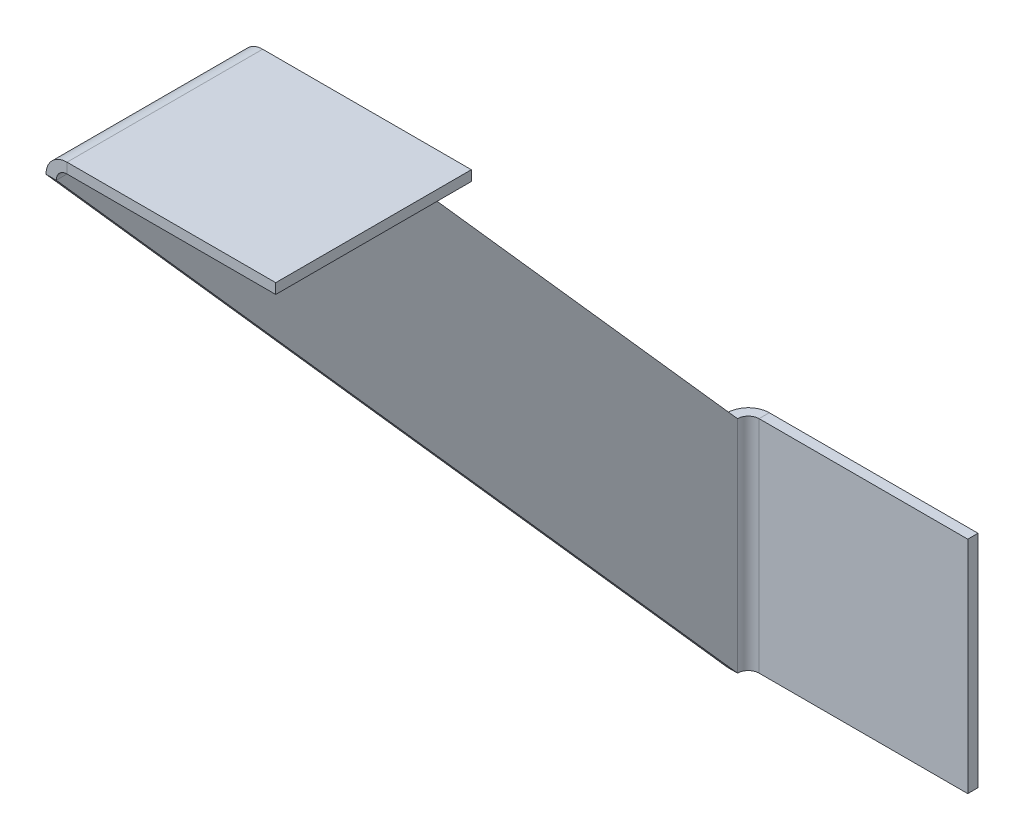
ISO-10303-21;
HEADER;
FILE_DESCRIPTION(('STEP AP214'),'2;1');
FILE_NAME('part.step','',(''),(''),'','','');
FILE_SCHEMA(('AUTOMOTIVE_DESIGN { 1 0 10303 214 1 1 1 1 }'));
ENDSEC;
DATA;
#1=APPLICATION_CONTEXT('core data for automotive mechanical design processes');
#2=APPLICATION_PROTOCOL_DEFINITION('international standard','automotive_design',2000,#1);
#3=PRODUCT_CONTEXT('',#1,'mechanical');
#4=PRODUCT('Part','Part','',(#3));
#5=PRODUCT_RELATED_PRODUCT_CATEGORY('part','',(#4));
#6=PRODUCT_DEFINITION_FORMATION('','',#4);
#7=PRODUCT_DEFINITION_CONTEXT('part definition',#1,'design');
#8=PRODUCT_DEFINITION('design','',#6,#7);
#9=PRODUCT_DEFINITION_SHAPE('','',#8);
#10=(LENGTH_UNIT() NAMED_UNIT(*) SI_UNIT(.MILLI.,.METRE.));
#11=(NAMED_UNIT(*) PLANE_ANGLE_UNIT() SI_UNIT($,.RADIAN.));
#12=(NAMED_UNIT(*) SI_UNIT($,.STERADIAN.) SOLID_ANGLE_UNIT());
#13=UNCERTAINTY_MEASURE_WITH_UNIT(LENGTH_MEASURE(1.E-05),#10,'distance_accuracy_value','');
#14=(GEOMETRIC_REPRESENTATION_CONTEXT(3) GLOBAL_UNCERTAINTY_ASSIGNED_CONTEXT((#13)) GLOBAL_UNIT_ASSIGNED_CONTEXT((#10,
#11,#12)) REPRESENTATION_CONTEXT('',''));
#15=CARTESIAN_POINT('',(0.,0.,0.));
#16=DIRECTION('',(0.,0.,1.));
#17=DIRECTION('',(1.,0.,0.));
#18=AXIS2_PLACEMENT_3D('',#15,#16,#17);
#19=CARTESIAN_POINT('',(-0.7,-37.3944766030146,-33.1911602627355));
#20=DIRECTION('',(0.,0.663823205254711,-0.747889532060292));
#21=DIRECTION('',(0.,0.747889532060292,0.663823205254711));
#22=AXIS2_PLACEMENT_3D('',#19,#20,#21);
#23=PLANE('',#22);
#24=DIRECTION('',(0.,0.747889532060292,0.66382320525471));
#25=VECTOR('',#24,1.);
#26=CARTESIAN_POINT('',(0.,-37.3944766030146,-33.1911602627355));
#27=LINE('',#26,#25);
#28=CARTESIAN_POINT('',(0.,-37.3944766030146,-33.1911602627355));
#29=VERTEX_POINT('',#28);
#30=CARTESIAN_POINT('',(0.,0.,0.));
#31=VERTEX_POINT('',#30);
#32=EDGE_CURVE('E112',#29,#31,#27,.T.);
#33=ORIENTED_EDGE('',*,*,#32,.F.);
#34=DIRECTION('',(1.,0.,0.));
#35=VECTOR('',#34,1.);
#36=CARTESIAN_POINT('',(-0.7,-37.3944766030146,-33.1911602627355));
#37=LINE('',#36,#35);
#38=CARTESIAN_POINT('',(-0.7,-37.3944766030146,-33.1911602627355));
#39=VERTEX_POINT('',#38);
#40=EDGE_CURVE('E13',#39,#29,#37,.T.);
#41=ORIENTED_EDGE('',*,*,#40,.F.);
#42=DIRECTION('',(0.,0.747889532060292,0.66382320525471));
#43=VECTOR('',#42,1.);
#44=CARTESIAN_POINT('',(-0.7,-37.3944766030146,-33.1911602627355));
#45=LINE('',#44,#43);
#46=CARTESIAN_POINT('',(-0.7,0.,0.));
#47=VERTEX_POINT('',#46);
#48=EDGE_CURVE('E132',#39,#47,#45,.T.);
#49=ORIENTED_EDGE('',*,*,#48,.T.);
#50=DIRECTION('',(1.,0.,0.));
#51=VECTOR('',#50,1.);
#52=CARTESIAN_POINT('',(-0.7,0.,0.));
#53=LINE('',#52,#51);
#54=EDGE_CURVE('E78',#47,#31,#53,.T.);
#55=ORIENTED_EDGE('',*,*,#54,.T.);
#56=EDGE_LOOP('',(#33,#41,#49,#55));
#57=FACE_BOUND('',#56,.T.);
#58=ADVANCED_FACE('F75',(#57),#23,.T.);
#59=CARTESIAN_POINT('',(-0.7,0.,13.3709586393754));
#60=DIRECTION('',(0.,-0.663823205254711,0.747889532060292));
#61=DIRECTION('',(0.,-0.747889532060292,-0.663823205254711));
#62=AXIS2_PLACEMENT_3D('',#59,#60,#61);
#63=PLANE('',#62);
#64=DIRECTION('',(0.,-0.747889532060292,-0.663823205254711));
#65=VECTOR('',#64,1.);
#66=CARTESIAN_POINT('',(0.,0.,13.3709586393754));
#67=LINE('',#66,#65);
#68=CARTESIAN_POINT('',(0.,0.,13.3709586393754));
#69=VERTEX_POINT('',#68);
#70=CARTESIAN_POINT('',(0.,-52.458728531603,-33.1911602627355));
#71=VERTEX_POINT('',#70);
#72=EDGE_CURVE('E127',#69,#71,#67,.T.);
#73=ORIENTED_EDGE('',*,*,#72,.F.);
#74=DIRECTION('',(1.,0.,0.));
#75=VECTOR('',#74,1.);
#76=CARTESIAN_POINT('',(-0.7,0.,13.3709586393754));
#77=LINE('',#76,#75);
#78=CARTESIAN_POINT('',(-0.699999999999999,0.,13.3709586393754));
#79=VERTEX_POINT('',#78);
#80=EDGE_CURVE('E214',#79,#69,#77,.T.);
#81=ORIENTED_EDGE('',*,*,#80,.F.);
#82=DIRECTION('',(0.,-0.747889532060292,-0.663823205254711));
#83=VECTOR('',#82,1.);
#84=CARTESIAN_POINT('',(-0.7,0.,13.3709586393754));
#85=LINE('',#84,#83);
#86=CARTESIAN_POINT('',(-0.7,-52.458728531603,-33.1911602627355));
#87=VERTEX_POINT('',#86);
#88=EDGE_CURVE('E93',#79,#87,#85,.T.);
#89=ORIENTED_EDGE('',*,*,#88,.T.);
#90=DIRECTION('',(1.,0.,0.));
#91=VECTOR('',#90,1.);
#92=CARTESIAN_POINT('',(-0.7,-52.458728531603,-33.1911602627355));
#93=LINE('',#92,#91);
#94=EDGE_CURVE('E84',#87,#71,#93,.T.);
#95=ORIENTED_EDGE('',*,*,#94,.T.);
#96=EDGE_LOOP('',(#73,#81,#89,#95));
#97=FACE_BOUND('',#96,.T.);
#98=ADVANCED_FACE('F338',(#97),#63,.T.);
#99=CARTESIAN_POINT('',(-0.7,0.,0.));
#100=DIRECTION('',(1.,0.,0.));
#101=DIRECTION('',(0.,0.,-1.));
#102=AXIS2_PLACEMENT_3D('',#99,#100,#101);
#103=PLANE('',#102);
#104=ORIENTED_EDGE('',*,*,#48,.F.);
#105=DIRECTION('',(0.,1.,0.));
#106=VECTOR('',#105,1.);
#107=CARTESIAN_POINT('',(-0.7,-52.458728531603,-33.1911602627355));
#108=LINE('',#107,#106);
#109=EDGE_CURVE('E210',#87,#39,#108,.T.);
#110=ORIENTED_EDGE('',*,*,#109,.F.);
#111=ORIENTED_EDGE('',*,*,#88,.F.);
#112=DIRECTION('',(0.,0.,1.));
#113=VECTOR('',#112,1.);
#114=CARTESIAN_POINT('',(-0.7,0.,0.));
#115=LINE('',#114,#113);
#116=EDGE_CURVE('E206',#47,#79,#115,.T.);
#117=ORIENTED_EDGE('',*,*,#116,.F.);
#118=EDGE_LOOP('',(#104,#110,#111,#117));
#119=FACE_BOUND('',#118,.T.);
#120=ADVANCED_FACE('F259',(#119),#103,.F.);
#121=CARTESIAN_POINT('',(0.,0.,0.));
#122=DIRECTION('',(1.,0.,0.));
#123=DIRECTION('',(0.,0.,-1.));
#124=AXIS2_PLACEMENT_3D('',#121,#122,#123);
#125=PLANE('',#124);
#126=ORIENTED_EDGE('',*,*,#32,.T.);
#127=DIRECTION('',(0.,0.,1.));
#128=VECTOR('',#127,1.);
#129=CARTESIAN_POINT('',(0.,0.,0.));
#130=LINE('',#129,#128);
#131=EDGE_CURVE('E121',#31,#69,#130,.T.);
#132=ORIENTED_EDGE('',*,*,#131,.T.);
#133=ORIENTED_EDGE('',*,*,#72,.T.);
#134=DIRECTION('',(0.,1.,0.));
#135=VECTOR('',#134,1.);
#136=CARTESIAN_POINT('',(0.,-52.458728531603,-33.1911602627355));
#137=LINE('',#136,#135);
#138=EDGE_CURVE('E125',#71,#29,#137,.T.);
#139=ORIENTED_EDGE('',*,*,#138,.T.);
#140=EDGE_LOOP('',(#126,#132,#133,#139));
#141=FACE_BOUND('',#140,.T.);
#142=ADVANCED_FACE('F126',(#141),#125,.T.);
#143=CARTESIAN_POINT('',(0.7366,0.,0.));
#144=DIRECTION('',(0.,0.,-1.));
#145=DIRECTION('',(0.,1.,0.));
#146=AXIS2_PLACEMENT_3D('',#143,#144,#145);
#147=PLANE('',#146);
#148=DIRECTION('',(0.,-1.,0.));
#149=VECTOR('',#148,1.);
#150=CARTESIAN_POINT('',(0.736599999999995,1.4366,0.));
#151=LINE('',#150,#149);
#152=CARTESIAN_POINT('',(0.736599999999998,0.7366,0.));
#153=VERTEX_POINT('',#152);
#154=CARTESIAN_POINT('',(0.736599999999995,1.4366,0.));
#155=VERTEX_POINT('',#154);
#156=EDGE_CURVE('E191',#153,#155,#151,.F.);
#157=ORIENTED_EDGE('',*,*,#156,.F.);
#158=CARTESIAN_POINT('',(0.7366,0.,0.));
#159=DIRECTION('',(0.,0.,1.));
#160=DIRECTION('',(0.,-1.,0.));
#161=AXIS2_PLACEMENT_3D('',#158,#159,#160);
#162=CIRCLE('',#161,0.736599999999999);
#163=EDGE_CURVE('E200',#31,#153,#162,.F.);
#164=ORIENTED_EDGE('',*,*,#163,.F.);
#165=ORIENTED_EDGE('',*,*,#54,.F.);
#166=CARTESIAN_POINT('',(0.7366,0.,0.));
#167=DIRECTION('',(0.,0.,1.));
#168=DIRECTION('',(0.,-1.,0.));
#169=AXIS2_PLACEMENT_3D('',#166,#167,#168);
#170=CIRCLE('',#169,1.4366);
#171=EDGE_CURVE('E122',#47,#155,#170,.F.);
#172=ORIENTED_EDGE('',*,*,#171,.T.);
#173=EDGE_LOOP('',(#157,#164,#165,#172));
#174=FACE_BOUND('',#173,.T.);
#175=ADVANCED_FACE('F348',(#174),#147,.T.);
#176=CARTESIAN_POINT('',(0.7366,0.,13.3709586393754));
#177=DIRECTION('',(0.,0.,-1.));
#178=DIRECTION('',(0.,1.,0.));
#179=AXIS2_PLACEMENT_3D('',#176,#177,#178);
#180=PLANE('',#179);
#181=CARTESIAN_POINT('',(0.7366,0.,13.3709586393754));
#182=DIRECTION('',(0.,0.,1.));
#183=DIRECTION('',(0.,-1.,0.));
#184=AXIS2_PLACEMENT_3D('',#181,#182,#183);
#185=CIRCLE('',#184,0.736599999999999);
#186=CARTESIAN_POINT('',(0.736599999999998,0.736599999999997,13.3709586393754));
#187=VERTEX_POINT('',#186);
#188=EDGE_CURVE('E160',#187,#69,#185,.T.);
#189=ORIENTED_EDGE('',*,*,#188,.F.);
#190=DIRECTION('',(0.,-1.,0.));
#191=VECTOR('',#190,1.);
#192=CARTESIAN_POINT('',(0.736599999999998,0.736599999999998,13.3709586393754));
#193=LINE('',#192,#191);
#194=CARTESIAN_POINT('',(0.736599999999995,1.4366,13.3709586393754));
#195=VERTEX_POINT('',#194);
#196=EDGE_CURVE('E185',#187,#195,#193,.F.);
#197=ORIENTED_EDGE('',*,*,#196,.T.);
#198=CARTESIAN_POINT('',(0.7366,0.,13.3709586393754));
#199=DIRECTION('',(0.,0.,1.));
#200=DIRECTION('',(0.,-1.,0.));
#201=AXIS2_PLACEMENT_3D('',#198,#199,#200);
#202=CIRCLE('',#201,1.4366);
#203=EDGE_CURVE('E197',#195,#79,#202,.T.);
#204=ORIENTED_EDGE('',*,*,#203,.T.);
#205=ORIENTED_EDGE('',*,*,#80,.T.);
#206=EDGE_LOOP('',(#189,#197,#204,#205));
#207=FACE_BOUND('',#206,.T.);
#208=ADVANCED_FACE('F218',(#207),#180,.F.);
#209=CARTESIAN_POINT('',(0.7366,0.,13.3709586393754));
#210=DIRECTION('',(0.,0.,1.));
#211=DIRECTION('',(0.,1.,0.));
#212=AXIS2_PLACEMENT_3D('',#209,#210,#211);
#213=CYLINDRICAL_SURFACE('',#212,1.4366);
#214=ORIENTED_EDGE('',*,*,#116,.T.);
#215=ORIENTED_EDGE('',*,*,#203,.F.);
#216=DIRECTION('',(0.,0.,1.));
#217=VECTOR('',#216,1.);
#218=CARTESIAN_POINT('',(0.736599999999995,1.4366,0.));
#219=LINE('',#218,#217);
#220=EDGE_CURVE('E182',#195,#155,#219,.F.);
#221=ORIENTED_EDGE('',*,*,#220,.T.);
#222=ORIENTED_EDGE('',*,*,#171,.F.);
#223=EDGE_LOOP('',(#214,#215,#221,#222));
#224=FACE_BOUND('',#223,.T.);
#225=ADVANCED_FACE('F352',(#224),#213,.T.);
#226=CARTESIAN_POINT('',(0.7366,0.,13.3709586393754));
#227=DIRECTION('',(0.,0.,1.));
#228=DIRECTION('',(0.,1.,0.));
#229=AXIS2_PLACEMENT_3D('',#226,#227,#228);
#230=CYLINDRICAL_SURFACE('',#229,0.736599999999999);
#231=ORIENTED_EDGE('',*,*,#131,.F.);
#232=ORIENTED_EDGE('',*,*,#163,.T.);
#233=DIRECTION('',(0.,0.,1.));
#234=VECTOR('',#233,1.);
#235=CARTESIAN_POINT('',(0.736599999999997,0.7366,0.));
#236=LINE('',#235,#234);
#237=EDGE_CURVE('E188',#153,#187,#236,.T.);
#238=ORIENTED_EDGE('',*,*,#237,.T.);
#239=ORIENTED_EDGE('',*,*,#188,.T.);
#240=EDGE_LOOP('',(#231,#232,#238,#239));
#241=FACE_BOUND('',#240,.T.);
#242=ADVANCED_FACE('F223',(#241),#230,.F.);
#243=CARTESIAN_POINT('',(0.,1.4366,0.));
#244=DIRECTION('',(0.,0.,1.));
#245=DIRECTION('',(0.,-1.,0.));
#246=AXIS2_PLACEMENT_3D('',#243,#244,#245);
#247=PLANE('',#246);
#248=ORIENTED_EDGE('',*,*,#156,.T.);
#249=DIRECTION('',(-1.,0.,0.));
#250=VECTOR('',#249,1.);
#251=CARTESIAN_POINT('',(0.,1.4366,0.));
#252=LINE('',#251,#250);
#253=CARTESIAN_POINT('',(15.,1.43660000000005,0.));
#254=VERTEX_POINT('',#253);
#255=EDGE_CURVE('E170',#254,#155,#252,.T.);
#256=ORIENTED_EDGE('',*,*,#255,.F.);
#257=DIRECTION('',(0.,-1.,0.));
#258=VECTOR('',#257,1.);
#259=CARTESIAN_POINT('',(15.,1.43660000000005,0.));
#260=LINE('',#259,#258);
#261=CARTESIAN_POINT('',(15.,0.73660000000005,0.));
#262=VERTEX_POINT('',#261);
#263=EDGE_CURVE('E161',#254,#262,#260,.T.);
#264=ORIENTED_EDGE('',*,*,#263,.T.);
#265=DIRECTION('',(1.,0.,0.));
#266=VECTOR('',#265,1.);
#267=CARTESIAN_POINT('',(0.,0.736599999999997,0.));
#268=LINE('',#267,#266);
#269=EDGE_CURVE('E179',#262,#153,#268,.F.);
#270=ORIENTED_EDGE('',*,*,#269,.T.);
#271=EDGE_LOOP('',(#248,#256,#264,#270));
#272=FACE_BOUND('',#271,.T.);
#273=ADVANCED_FACE('F238',(#272),#247,.F.);
#274=CARTESIAN_POINT('',(15.,1.43660000000005,13.3709586393754));
#275=DIRECTION('',(0.,0.,-1.));
#276=DIRECTION('',(0.,1.,0.));
#277=AXIS2_PLACEMENT_3D('',#274,#275,#276);
#278=PLANE('',#277);
#279=ORIENTED_EDGE('',*,*,#196,.F.);
#280=DIRECTION('',(-1.,0.,0.));
#281=VECTOR('',#280,1.);
#282=CARTESIAN_POINT('',(15.,0.736600000000048,13.3709586393754));
#283=LINE('',#282,#281);
#284=CARTESIAN_POINT('',(15.,0.736600000000048,13.3709586393754));
#285=VERTEX_POINT('',#284);
#286=EDGE_CURVE('E176',#187,#285,#283,.F.);
#287=ORIENTED_EDGE('',*,*,#286,.T.);
#288=DIRECTION('',(0.,-1.,0.));
#289=VECTOR('',#288,1.);
#290=CARTESIAN_POINT('',(15.,1.43660000000005,13.3709586393754));
#291=LINE('',#290,#289);
#292=CARTESIAN_POINT('',(15.,1.43660000000005,13.3709586393754));
#293=VERTEX_POINT('',#292);
#294=EDGE_CURVE('E157',#293,#285,#291,.T.);
#295=ORIENTED_EDGE('',*,*,#294,.F.);
#296=DIRECTION('',(1.,0.,0.));
#297=VECTOR('',#296,1.);
#298=CARTESIAN_POINT('',(0.,1.4366,13.3709586393754));
#299=LINE('',#298,#297);
#300=EDGE_CURVE('E167',#195,#293,#299,.T.);
#301=ORIENTED_EDGE('',*,*,#300,.F.);
#302=EDGE_LOOP('',(#279,#287,#295,#301));
#303=FACE_BOUND('',#302,.T.);
#304=ADVANCED_FACE('F363',(#303),#278,.F.);
#305=CARTESIAN_POINT('',(0.,1.4366,0.));
#306=DIRECTION('',(0.,-1.,0.));
#307=DIRECTION('',(1.,0.,0.));
#308=AXIS2_PLACEMENT_3D('',#305,#306,#307);
#309=PLANE('',#308);
#310=ORIENTED_EDGE('',*,*,#220,.F.);
#311=ORIENTED_EDGE('',*,*,#300,.T.);
#312=DIRECTION('',(0.,0.,-1.));
#313=VECTOR('',#312,1.);
#314=CARTESIAN_POINT('',(15.,1.43660000000005,0.));
#315=LINE('',#314,#313);
#316=EDGE_CURVE('E164',#293,#254,#315,.T.);
#317=ORIENTED_EDGE('',*,*,#316,.T.);
#318=ORIENTED_EDGE('',*,*,#255,.T.);
#319=EDGE_LOOP('',(#310,#311,#317,#318));
#320=FACE_BOUND('',#319,.T.);
#321=ADVANCED_FACE('F366',(#320),#309,.F.);
#322=CARTESIAN_POINT('',(0.,0.736599999999997,0.));
#323=DIRECTION('',(0.,-1.,0.));
#324=DIRECTION('',(1.,0.,0.));
#325=AXIS2_PLACEMENT_3D('',#322,#323,#324);
#326=PLANE('',#325);
#327=ORIENTED_EDGE('',*,*,#286,.F.);
#328=ORIENTED_EDGE('',*,*,#237,.F.);
#329=ORIENTED_EDGE('',*,*,#269,.F.);
#330=DIRECTION('',(0.,0.,1.));
#331=VECTOR('',#330,1.);
#332=CARTESIAN_POINT('',(15.,0.73660000000005,0.));
#333=LINE('',#332,#331);
#334=EDGE_CURVE('E173',#285,#262,#333,.F.);
#335=ORIENTED_EDGE('',*,*,#334,.F.);
#336=EDGE_LOOP('',(#327,#328,#329,#335));
#337=FACE_BOUND('',#336,.T.);
#338=ADVANCED_FACE('F231',(#337),#326,.T.);
#339=CARTESIAN_POINT('',(15.,1.43660000000005,0.));
#340=DIRECTION('',(-1.,0.,0.));
#341=DIRECTION('',(0.,-1.,0.));
#342=AXIS2_PLACEMENT_3D('',#339,#340,#341);
#343=PLANE('',#342);
#344=ORIENTED_EDGE('',*,*,#334,.T.);
#345=ORIENTED_EDGE('',*,*,#263,.F.);
#346=ORIENTED_EDGE('',*,*,#316,.F.);
#347=ORIENTED_EDGE('',*,*,#294,.T.);
#348=EDGE_LOOP('',(#344,#345,#346,#347));
#349=FACE_BOUND('',#348,.T.);
#350=ADVANCED_FACE('F246',(#349),#343,.F.);
#351=CARTESIAN_POINT('',(0.736599999999997,-52.458728531603,-33.1911602627355));
#352=DIRECTION('',(0.,-1.,0.));
#353=DIRECTION('',(0.,0.,-1.));
#354=AXIS2_PLACEMENT_3D('',#351,#352,#353);
#355=PLANE('',#354);
#356=DIRECTION('',(0.,0.,1.));
#357=VECTOR('',#356,1.);
#358=CARTESIAN_POINT('',(0.736599999999997,-52.458728531603,-34.6277602627355));
#359=LINE('',#358,#357);
#360=CARTESIAN_POINT('',(0.736599999999994,-52.458728531603,-33.9277602627355));
#361=VERTEX_POINT('',#360);
#362=CARTESIAN_POINT('',(0.736599999999992,-52.458728531603,-34.6277602627355));
#363=VERTEX_POINT('',#362);
#364=EDGE_CURVE('E274',#361,#363,#359,.F.);
#365=ORIENTED_EDGE('',*,*,#364,.F.);
#366=CARTESIAN_POINT('',(0.736599999999997,-52.458728531603,-33.1911602627355));
#367=DIRECTION('',(0.,1.,0.));
#368=DIRECTION('',(0.,0.,1.));
#369=AXIS2_PLACEMENT_3D('',#366,#367,#368);
#370=CIRCLE('',#369,0.736599999999997);
#371=EDGE_CURVE('E148',#71,#361,#370,.F.);
#372=ORIENTED_EDGE('',*,*,#371,.F.);
#373=ORIENTED_EDGE('',*,*,#94,.F.);
#374=CARTESIAN_POINT('',(0.736599999999997,-52.458728531603,-33.1911602627355));
#375=DIRECTION('',(0.,1.,0.));
#376=DIRECTION('',(0.,0.,1.));
#377=AXIS2_PLACEMENT_3D('',#374,#375,#376);
#378=CIRCLE('',#377,1.4366);
#379=EDGE_CURVE('E194',#87,#363,#378,.F.);
#380=ORIENTED_EDGE('',*,*,#379,.T.);
#381=EDGE_LOOP('',(#365,#372,#373,#380));
#382=FACE_BOUND('',#381,.T.);
#383=ADVANCED_FACE('F265',(#382),#355,.T.);
#384=CARTESIAN_POINT('',(0.736599999999997,-37.3944766030146,-33.1911602627355));
#385=DIRECTION('',(0.,-1.,0.));
#386=DIRECTION('',(0.,0.,-1.));
#387=AXIS2_PLACEMENT_3D('',#384,#385,#386);
#388=PLANE('',#387);
#389=CARTESIAN_POINT('',(0.736599999999997,-37.3944766030146,-33.1911602627355));
#390=DIRECTION('',(0.,1.,0.));
#391=DIRECTION('',(0.,0.,1.));
#392=AXIS2_PLACEMENT_3D('',#389,#390,#391);
#393=CIRCLE('',#392,0.736599999999997);
#394=CARTESIAN_POINT('',(0.736599999999994,-37.3944766030146,-33.9277602627355));
#395=VERTEX_POINT('',#394);
#396=EDGE_CURVE('E140',#395,#29,#393,.T.);
#397=ORIENTED_EDGE('',*,*,#396,.F.);
#398=DIRECTION('',(0.,0.,1.));
#399=VECTOR('',#398,1.);
#400=CARTESIAN_POINT('',(0.736599999999997,-37.3944766030146,-33.9277602627355));
#401=LINE('',#400,#399);
#402=CARTESIAN_POINT('',(0.736599999999997,-37.3944766030146,-34.6277602627355));
#403=VERTEX_POINT('',#402);
#404=EDGE_CURVE('E277',#395,#403,#401,.F.);
#405=ORIENTED_EDGE('',*,*,#404,.T.);
#406=CARTESIAN_POINT('',(0.736599999999997,-37.3944766030146,-33.1911602627355));
#407=DIRECTION('',(0.,1.,0.));
#408=DIRECTION('',(0.,0.,1.));
#409=AXIS2_PLACEMENT_3D('',#406,#407,#408);
#410=CIRCLE('',#409,1.4366);
#411=EDGE_CURVE('E143',#403,#39,#410,.T.);
#412=ORIENTED_EDGE('',*,*,#411,.T.);
#413=ORIENTED_EDGE('',*,*,#40,.T.);
#414=EDGE_LOOP('',(#397,#405,#412,#413));
#415=FACE_BOUND('',#414,.T.);
#416=ADVANCED_FACE('F137',(#415),#388,.F.);
#417=CARTESIAN_POINT('',(0.736599999999997,-37.3944766030146,-33.1911602627355));
#418=DIRECTION('',(0.,1.,0.));
#419=DIRECTION('',(0.,0.,-1.));
#420=AXIS2_PLACEMENT_3D('',#417,#418,#419);
#421=CYLINDRICAL_SURFACE('',#420,1.4366);
#422=ORIENTED_EDGE('',*,*,#109,.T.);
#423=ORIENTED_EDGE('',*,*,#411,.F.);
#424=DIRECTION('',(0.,1.,0.));
#425=VECTOR('',#424,1.);
#426=CARTESIAN_POINT('',(0.736599999999997,-52.458728531603,-34.6277602627355));
#427=LINE('',#426,#425);
#428=EDGE_CURVE('E271',#403,#363,#427,.F.);
#429=ORIENTED_EDGE('',*,*,#428,.T.);
#430=ORIENTED_EDGE('',*,*,#379,.F.);
#431=EDGE_LOOP('',(#422,#423,#429,#430));
#432=FACE_BOUND('',#431,.T.);
#433=ADVANCED_FACE('F269',(#432),#421,.T.);
#434=CARTESIAN_POINT('',(0.736599999999997,-37.3944766030146,-33.1911602627355));
#435=DIRECTION('',(0.,1.,0.));
#436=DIRECTION('',(0.,0.,-1.));
#437=AXIS2_PLACEMENT_3D('',#434,#435,#436);
#438=CYLINDRICAL_SURFACE('',#437,0.736599999999997);
#439=ORIENTED_EDGE('',*,*,#138,.F.);
#440=ORIENTED_EDGE('',*,*,#371,.T.);
#441=DIRECTION('',(0.,1.,0.));
#442=VECTOR('',#441,1.);
#443=CARTESIAN_POINT('',(0.736599999999997,-52.458728531603,-33.9277602627355));
#444=LINE('',#443,#442);
#445=EDGE_CURVE('E147',#361,#395,#444,.T.);
#446=ORIENTED_EDGE('',*,*,#445,.T.);
#447=ORIENTED_EDGE('',*,*,#396,.T.);
#448=EDGE_LOOP('',(#439,#440,#446,#447));
#449=FACE_BOUND('',#448,.T.);
#450=ADVANCED_FACE('F145',(#449),#438,.F.);
#451=CARTESIAN_POINT('',(0.,-52.458728531603,-34.6277602627355));
#452=DIRECTION('',(0.,1.,0.));
#453=DIRECTION('',(0.,0.,1.));
#454=AXIS2_PLACEMENT_3D('',#451,#452,#453);
#455=PLANE('',#454);
#456=ORIENTED_EDGE('',*,*,#364,.T.);
#457=DIRECTION('',(-1.,0.,0.));
#458=VECTOR('',#457,1.);
#459=CARTESIAN_POINT('',(-1.25276004729565E-13,-52.458728531603,-34.6277602627355));
#460=LINE('',#459,#458);
#461=CARTESIAN_POINT('',(15.,-52.458728531603,-34.6277602627356));
#462=VERTEX_POINT('',#461);
#463=EDGE_CURVE('E289',#462,#363,#460,.T.);
#464=ORIENTED_EDGE('',*,*,#463,.F.);
#465=DIRECTION('',(0.,0.,1.));
#466=VECTOR('',#465,1.);
#467=CARTESIAN_POINT('',(15.,-52.458728531603,-34.6277602627356));
#468=LINE('',#467,#466);
#469=CARTESIAN_POINT('',(15.,-52.458728531603,-33.9277602627356));
#470=VERTEX_POINT('',#469);
#471=EDGE_CURVE('E153',#462,#470,#468,.T.);
#472=ORIENTED_EDGE('',*,*,#471,.T.);
#473=DIRECTION('',(1.,0.,0.));
#474=VECTOR('',#473,1.);
#475=CARTESIAN_POINT('',(0.,-52.458728531603,-33.9277602627355));
#476=LINE('',#475,#474);
#477=EDGE_CURVE('E280',#470,#361,#476,.F.);
#478=ORIENTED_EDGE('',*,*,#477,.T.);
#479=EDGE_LOOP('',(#456,#464,#472,#478));
#480=FACE_BOUND('',#479,.T.);
#481=ADVANCED_FACE('F304',(#480),#455,.F.);
#482=CARTESIAN_POINT('',(15.,-37.3944766030146,-34.6277602627356));
#483=DIRECTION('',(0.,-1.,0.));
#484=DIRECTION('',(0.,0.,-1.));
#485=AXIS2_PLACEMENT_3D('',#482,#483,#484);
#486=PLANE('',#485);
#487=ORIENTED_EDGE('',*,*,#404,.F.);
#488=DIRECTION('',(-1.,0.,0.));
#489=VECTOR('',#488,1.);
#490=CARTESIAN_POINT('',(15.,-37.3944766030146,-33.9277602627356));
#491=LINE('',#490,#489);
#492=CARTESIAN_POINT('',(15.,-37.3944766030146,-33.9277602627356));
#493=VERTEX_POINT('',#492);
#494=EDGE_CURVE('E283',#395,#493,#491,.F.);
#495=ORIENTED_EDGE('',*,*,#494,.T.);
#496=DIRECTION('',(0.,0.,1.));
#497=VECTOR('',#496,1.);
#498=CARTESIAN_POINT('',(15.,-37.3944766030146,-34.6277602627356));
#499=LINE('',#498,#497);
#500=CARTESIAN_POINT('',(15.,-37.3944766030146,-34.6277602627356));
#501=VERTEX_POINT('',#500);
#502=EDGE_CURVE('E149',#501,#493,#499,.T.);
#503=ORIENTED_EDGE('',*,*,#502,.F.);
#504=DIRECTION('',(1.,0.,0.));
#505=VECTOR('',#504,1.);
#506=CARTESIAN_POINT('',(-1.25276004729565E-13,-37.3944766030146,-34.6277602627355));
#507=LINE('',#506,#505);
#508=EDGE_CURVE('E292',#403,#501,#507,.T.);
#509=ORIENTED_EDGE('',*,*,#508,.F.);
#510=EDGE_LOOP('',(#487,#495,#503,#509));
#511=FACE_BOUND('',#510,.T.);
#512=ADVANCED_FACE('F328',(#511),#486,.F.);
#513=CARTESIAN_POINT('',(-1.25276004729565E-13,0.,-34.6277602627355));
#514=DIRECTION('',(0.,0.,1.));
#515=DIRECTION('',(1.,0.,0.));
#516=AXIS2_PLACEMENT_3D('',#513,#514,#515);
#517=PLANE('',#516);
#518=ORIENTED_EDGE('',*,*,#428,.F.);
#519=ORIENTED_EDGE('',*,*,#508,.T.);
#520=DIRECTION('',(0.,-1.,0.));
#521=VECTOR('',#520,1.);
#522=CARTESIAN_POINT('',(15.,0.,-34.6277602627356));
#523=LINE('',#522,#521);
#524=EDGE_CURVE('E295',#501,#462,#523,.T.);
#525=ORIENTED_EDGE('',*,*,#524,.T.);
#526=ORIENTED_EDGE('',*,*,#463,.T.);
#527=EDGE_LOOP('',(#518,#519,#525,#526));
#528=FACE_BOUND('',#527,.T.);
#529=ADVANCED_FACE('F326',(#528),#517,.F.);
#530=CARTESIAN_POINT('',(-1.22831967792375E-13,0.,-33.9277602627355));
#531=DIRECTION('',(0.,0.,1.));
#532=DIRECTION('',(1.,0.,0.));
#533=AXIS2_PLACEMENT_3D('',#530,#531,#532);
#534=PLANE('',#533);
#535=ORIENTED_EDGE('',*,*,#494,.F.);
#536=ORIENTED_EDGE('',*,*,#445,.F.);
#537=ORIENTED_EDGE('',*,*,#477,.F.);
#538=DIRECTION('',(0.,1.,0.));
#539=VECTOR('',#538,1.);
#540=CARTESIAN_POINT('',(15.,-52.458728531603,-33.9277602627356));
#541=LINE('',#540,#539);
#542=EDGE_CURVE('E286',#493,#470,#541,.F.);
#543=ORIENTED_EDGE('',*,*,#542,.F.);
#544=EDGE_LOOP('',(#535,#536,#537,#543));
#545=FACE_BOUND('',#544,.T.);
#546=ADVANCED_FACE('F315',(#545),#534,.T.);
#547=CARTESIAN_POINT('',(15.,-52.458728531603,-34.6277602627356));
#548=DIRECTION('',(-1.,0.,0.));
#549=DIRECTION('',(0.,0.,1.));
#550=AXIS2_PLACEMENT_3D('',#547,#548,#549);
#551=PLANE('',#550);
#552=ORIENTED_EDGE('',*,*,#542,.T.);
#553=ORIENTED_EDGE('',*,*,#471,.F.);
#554=ORIENTED_EDGE('',*,*,#524,.F.);
#555=ORIENTED_EDGE('',*,*,#502,.T.);
#556=EDGE_LOOP('',(#552,#553,#554,#555));
#557=FACE_BOUND('',#556,.T.);
#558=ADVANCED_FACE('F329',(#557),#551,.F.);
#559=CLOSED_SHELL('',(#58,#98,#120,#142,#175,#208,#225,#242,#273,#304,#321,#338,#350,#383,#416,
#433,#450,#481,#512,#529,#546,#558));
#560=MANIFOLD_SOLID_BREP('B2',#559);
#561=ADVANCED_BREP_SHAPE_REPRESENTATION('',(#18,#560),#14);
#562=SHAPE_DEFINITION_REPRESENTATION(#9,#561);
ENDSEC;
END-ISO-10303-21;
